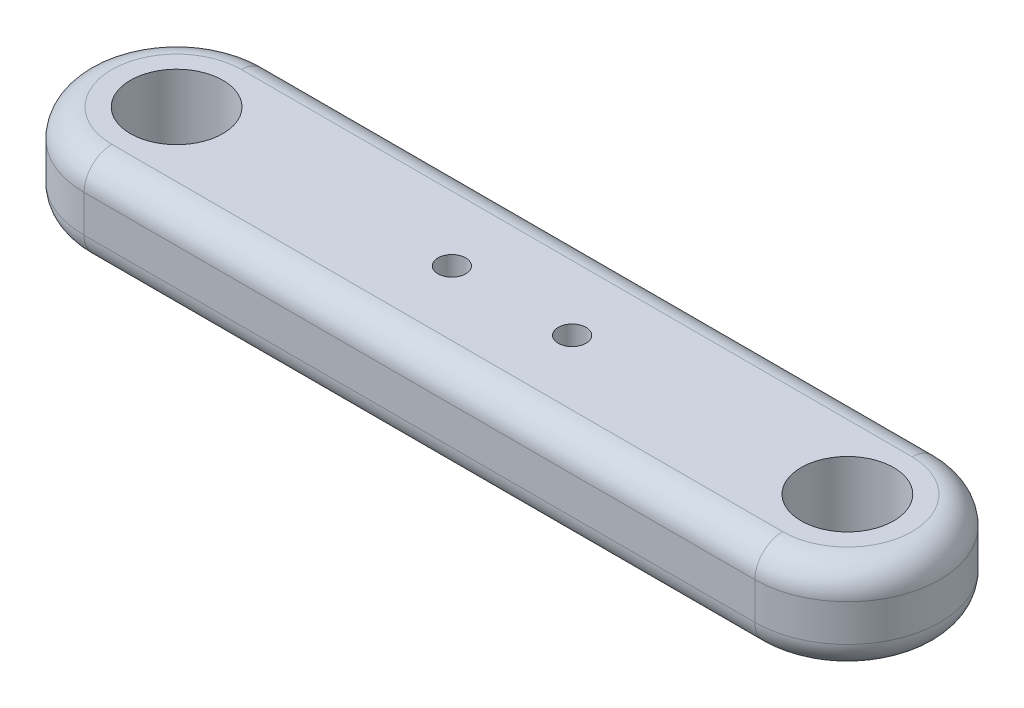
ISO-10303-21;
HEADER;
FILE_DESCRIPTION(('STEP AP214'),'2;1');
FILE_NAME('part.step','',(''),(''),'','','');
FILE_SCHEMA(('AUTOMOTIVE_DESIGN { 1 0 10303 214 1 1 1 1 }'));
ENDSEC;
DATA;
#1=APPLICATION_CONTEXT('core data for automotive mechanical design processes');
#2=APPLICATION_PROTOCOL_DEFINITION('international standard','automotive_design',2000,#1);
#3=PRODUCT_CONTEXT('',#1,'mechanical');
#4=PRODUCT('Part','Part','',(#3));
#5=PRODUCT_RELATED_PRODUCT_CATEGORY('part','',(#4));
#6=PRODUCT_DEFINITION_FORMATION('','',#4);
#7=PRODUCT_DEFINITION_CONTEXT('part definition',#1,'design');
#8=PRODUCT_DEFINITION('design','',#6,#7);
#9=PRODUCT_DEFINITION_SHAPE('','',#8);
#10=(LENGTH_UNIT() NAMED_UNIT(*) SI_UNIT(.MILLI.,.METRE.));
#11=(NAMED_UNIT(*) PLANE_ANGLE_UNIT() SI_UNIT($,.RADIAN.));
#12=(NAMED_UNIT(*) SI_UNIT($,.STERADIAN.) SOLID_ANGLE_UNIT());
#13=UNCERTAINTY_MEASURE_WITH_UNIT(LENGTH_MEASURE(1.E-05),#10,'distance_accuracy_value','');
#14=(GEOMETRIC_REPRESENTATION_CONTEXT(3) GLOBAL_UNCERTAINTY_ASSIGNED_CONTEXT((#13)) GLOBAL_UNIT_ASSIGNED_CONTEXT((#10,
#11,#12)) REPRESENTATION_CONTEXT('',''));
#15=CARTESIAN_POINT('',(0.,0.,0.));
#16=DIRECTION('',(0.,0.,1.));
#17=DIRECTION('',(1.,0.,0.));
#18=AXIS2_PLACEMENT_3D('',#15,#16,#17);
#19=CARTESIAN_POINT('',(0.,10.,10.));
#20=DIRECTION('',(0.,0.,1.));
#21=DIRECTION('',(1.,0.,0.));
#22=AXIS2_PLACEMENT_3D('',#19,#20,#21);
#23=PLANE('',#22);
#24=DIRECTION('',(0.,-1.,0.));
#25=VECTOR('',#24,1.);
#26=CARTESIAN_POINT('',(-36.25,10.,10.));
#27=LINE('',#26,#25);
#28=CARTESIAN_POINT('',(-36.25,7.,10.));
#29=VERTEX_POINT('',#28);
#30=CARTESIAN_POINT('',(-36.25,3.,10.));
#31=VERTEX_POINT('',#30);
#32=EDGE_CURVE('E104',#29,#31,#27,.T.);
#33=ORIENTED_EDGE('',*,*,#32,.T.);
#34=DIRECTION('',(-1.,0.,0.));
#35=VECTOR('',#34,1.);
#36=CARTESIAN_POINT('',(36.25,3.,10.));
#37=LINE('',#36,#35);
#38=CARTESIAN_POINT('',(36.25,3.,10.));
#39=VERTEX_POINT('',#38);
#40=EDGE_CURVE('E110',#31,#39,#37,.F.);
#41=ORIENTED_EDGE('',*,*,#40,.T.);
#42=DIRECTION('',(0.,-1.,0.));
#43=VECTOR('',#42,1.);
#44=CARTESIAN_POINT('',(36.25,10.,10.));
#45=LINE('',#44,#43);
#46=CARTESIAN_POINT('',(36.25,7.,10.));
#47=VERTEX_POINT('',#46);
#48=EDGE_CURVE('E106',#47,#39,#45,.T.);
#49=ORIENTED_EDGE('',*,*,#48,.F.);
#50=DIRECTION('',(-1.,0.,0.));
#51=VECTOR('',#50,1.);
#52=CARTESIAN_POINT('',(0.,7.,10.));
#53=LINE('',#52,#51);
#54=EDGE_CURVE('E102',#47,#29,#53,.T.);
#55=ORIENTED_EDGE('',*,*,#54,.T.);
#56=EDGE_LOOP('',(#33,#41,#49,#55));
#57=FACE_BOUND('',#56,.T.);
#58=ADVANCED_FACE('F33',(#57),#23,.T.);
#59=CARTESIAN_POINT('',(36.25,10.,0.));
#60=DIRECTION('',(0.,-1.,0.));
#61=DIRECTION('',(0.,0.,-1.));
#62=AXIS2_PLACEMENT_3D('',#59,#60,#61);
#63=CYLINDRICAL_SURFACE('',#62,10.);
#64=ORIENTED_EDGE('',*,*,#48,.T.);
#65=CARTESIAN_POINT('',(36.25,3.,0.));
#66=DIRECTION('',(0.,1.,0.));
#67=DIRECTION('',(0.,0.,1.));
#68=AXIS2_PLACEMENT_3D('',#65,#66,#67);
#69=CIRCLE('',#68,10.);
#70=CARTESIAN_POINT('',(36.25,3.,-10.));
#71=VERTEX_POINT('',#70);
#72=EDGE_CURVE('E184',#39,#71,#69,.T.);
#73=ORIENTED_EDGE('',*,*,#72,.T.);
#74=DIRECTION('',(0.,-1.,0.));
#75=VECTOR('',#74,1.);
#76=CARTESIAN_POINT('',(36.25,10.,-10.));
#77=LINE('',#76,#75);
#78=CARTESIAN_POINT('',(36.25,7.,-10.));
#79=VERTEX_POINT('',#78);
#80=EDGE_CURVE('E168',#79,#71,#77,.T.);
#81=ORIENTED_EDGE('',*,*,#80,.F.);
#82=CARTESIAN_POINT('',(36.25,7.,0.));
#83=DIRECTION('',(0.,1.,0.));
#84=DIRECTION('',(0.,0.,1.));
#85=AXIS2_PLACEMENT_3D('',#82,#83,#84);
#86=CIRCLE('',#85,10.);
#87=EDGE_CURVE('E182',#79,#47,#86,.F.);
#88=ORIENTED_EDGE('',*,*,#87,.T.);
#89=EDGE_LOOP('',(#64,#73,#81,#88));
#90=FACE_BOUND('',#89,.T.);
#91=ADVANCED_FACE('F222',(#90),#63,.T.);
#92=CARTESIAN_POINT('',(0.,10.,-10.));
#93=DIRECTION('',(0.,0.,-1.));
#94=DIRECTION('',(-1.,0.,0.));
#95=AXIS2_PLACEMENT_3D('',#92,#93,#94);
#96=PLANE('',#95);
#97=ORIENTED_EDGE('',*,*,#80,.T.);
#98=DIRECTION('',(1.,0.,0.));
#99=VECTOR('',#98,1.);
#100=CARTESIAN_POINT('',(-36.25,3.,-10.));
#101=LINE('',#100,#99);
#102=CARTESIAN_POINT('',(-36.25,3.,-10.));
#103=VERTEX_POINT('',#102);
#104=EDGE_CURVE('E11',#71,#103,#101,.F.);
#105=ORIENTED_EDGE('',*,*,#104,.T.);
#106=DIRECTION('',(0.,-1.,0.));
#107=VECTOR('',#106,1.);
#108=CARTESIAN_POINT('',(-36.25,10.,-10.));
#109=LINE('',#108,#107);
#110=CARTESIAN_POINT('',(-36.25,7.,-10.));
#111=VERTEX_POINT('',#110);
#112=EDGE_CURVE('E122',#111,#103,#109,.T.);
#113=ORIENTED_EDGE('',*,*,#112,.F.);
#114=DIRECTION('',(1.,0.,0.));
#115=VECTOR('',#114,1.);
#116=CARTESIAN_POINT('',(0.,7.,-10.));
#117=LINE('',#116,#115);
#118=EDGE_CURVE('E42',#111,#79,#117,.T.);
#119=ORIENTED_EDGE('',*,*,#118,.T.);
#120=EDGE_LOOP('',(#97,#105,#113,#119));
#121=FACE_BOUND('',#120,.T.);
#122=ADVANCED_FACE('F243',(#121),#96,.T.);
#123=CARTESIAN_POINT('',(36.25,10.,0.));
#124=DIRECTION('',(0.,-1.,0.));
#125=DIRECTION('',(0.,0.,-1.));
#126=AXIS2_PLACEMENT_3D('',#123,#124,#125);
#127=CYLINDRICAL_SURFACE('',#126,5.);
#128=CARTESIAN_POINT('',(36.25,10.,0.));
#129=DIRECTION('',(0.,1.,0.));
#130=DIRECTION('',(0.,0.,1.));
#131=AXIS2_PLACEMENT_3D('',#128,#129,#130);
#132=CIRCLE('',#131,5.);
#133=CARTESIAN_POINT('',(36.25,10.,5.));
#134=VERTEX_POINT('',#133);
#135=EDGE_CURVE('E123',#134,#134,#132,.T.);
#136=ORIENTED_EDGE('',*,*,#135,.T.);
#137=EDGE_LOOP('',(#136));
#138=FACE_BOUND('',#137,.T.);
#139=CARTESIAN_POINT('',(36.25,0.,0.));
#140=DIRECTION('',(0.,1.,0.));
#141=DIRECTION('',(0.,0.,1.));
#142=AXIS2_PLACEMENT_3D('',#139,#140,#141);
#143=CIRCLE('',#142,5.);
#144=CARTESIAN_POINT('',(36.25,0.,5.));
#145=VERTEX_POINT('',#144);
#146=EDGE_CURVE('E159',#145,#145,#143,.T.);
#147=ORIENTED_EDGE('',*,*,#146,.F.);
#148=EDGE_LOOP('',(#147));
#149=FACE_BOUND('',#148,.T.);
#150=ADVANCED_FACE('F239',(#138,#149),#127,.F.);
#151=CARTESIAN_POINT('',(-36.25,10.,0.));
#152=DIRECTION('',(0.,-1.,0.));
#153=DIRECTION('',(0.,0.,-1.));
#154=AXIS2_PLACEMENT_3D('',#151,#152,#153);
#155=CYLINDRICAL_SURFACE('',#154,5.);
#156=CARTESIAN_POINT('',(-36.25,10.,0.));
#157=DIRECTION('',(0.,1.,0.));
#158=DIRECTION('',(0.,0.,1.));
#159=AXIS2_PLACEMENT_3D('',#156,#157,#158);
#160=CIRCLE('',#159,5.);
#161=CARTESIAN_POINT('',(-36.25,10.,5.00000000000001));
#162=VERTEX_POINT('',#161);
#163=EDGE_CURVE('E156',#162,#162,#160,.T.);
#164=ORIENTED_EDGE('',*,*,#163,.T.);
#165=EDGE_LOOP('',(#164));
#166=FACE_BOUND('',#165,.T.);
#167=CARTESIAN_POINT('',(-36.25,0.,0.));
#168=DIRECTION('',(0.,1.,0.));
#169=DIRECTION('',(0.,0.,1.));
#170=AXIS2_PLACEMENT_3D('',#167,#168,#169);
#171=CIRCLE('',#170,5.);
#172=CARTESIAN_POINT('',(-36.25,0.,5.00000000000001));
#173=VERTEX_POINT('',#172);
#174=EDGE_CURVE('E162',#173,#173,#171,.T.);
#175=ORIENTED_EDGE('',*,*,#174,.F.);
#176=EDGE_LOOP('',(#175));
#177=FACE_BOUND('',#176,.T.);
#178=ADVANCED_FACE('F242',(#166,#177),#155,.F.);
#179=CARTESIAN_POINT('',(-36.25,10.,0.));
#180=DIRECTION('',(0.,-1.,0.));
#181=DIRECTION('',(0.,0.,-1.));
#182=AXIS2_PLACEMENT_3D('',#179,#180,#181);
#183=CYLINDRICAL_SURFACE('',#182,10.);
#184=ORIENTED_EDGE('',*,*,#112,.T.);
#185=CARTESIAN_POINT('',(-36.25,3.,0.));
#186=DIRECTION('',(0.,1.,0.));
#187=DIRECTION('',(0.,0.,1.));
#188=AXIS2_PLACEMENT_3D('',#185,#186,#187);
#189=CIRCLE('',#188,10.);
#190=EDGE_CURVE('E121',#103,#31,#189,.T.);
#191=ORIENTED_EDGE('',*,*,#190,.T.);
#192=ORIENTED_EDGE('',*,*,#32,.F.);
#193=CARTESIAN_POINT('',(-36.25,7.,0.));
#194=DIRECTION('',(0.,1.,0.));
#195=DIRECTION('',(0.,0.,1.));
#196=AXIS2_PLACEMENT_3D('',#193,#194,#195);
#197=CIRCLE('',#196,10.);
#198=EDGE_CURVE('E118',#29,#111,#197,.F.);
#199=ORIENTED_EDGE('',*,*,#198,.T.);
#200=EDGE_LOOP('',(#184,#191,#192,#199));
#201=FACE_BOUND('',#200,.T.);
#202=ADVANCED_FACE('F117',(#201),#183,.T.);
#203=CARTESIAN_POINT('',(0.,10.,0.));
#204=DIRECTION('',(0.,1.,0.));
#205=DIRECTION('',(0.,0.,1.));
#206=AXIS2_PLACEMENT_3D('',#203,#204,#205);
#207=PLANE('',#206);
#208=CARTESIAN_POINT('',(-6.5,10.,0.));
#209=DIRECTION('',(0.,1.,0.));
#210=DIRECTION('',(0.,0.,1.));
#211=AXIS2_PLACEMENT_3D('',#208,#209,#210);
#212=CIRCLE('',#211,1.5);
#213=CARTESIAN_POINT('',(-6.5,10.,1.5));
#214=VERTEX_POINT('',#213);
#215=EDGE_CURVE('E145',#214,#214,#212,.T.);
#216=ORIENTED_EDGE('',*,*,#215,.F.);
#217=EDGE_LOOP('',(#216));
#218=FACE_BOUND('',#217,.T.);
#219=CARTESIAN_POINT('',(6.5,10.,0.));
#220=DIRECTION('',(0.,1.,0.));
#221=DIRECTION('',(0.,0.,1.));
#222=AXIS2_PLACEMENT_3D('',#219,#220,#221);
#223=CIRCLE('',#222,1.5);
#224=CARTESIAN_POINT('',(6.5,10.,1.5));
#225=VERTEX_POINT('',#224);
#226=EDGE_CURVE('E149',#225,#225,#223,.T.);
#227=ORIENTED_EDGE('',*,*,#226,.F.);
#228=EDGE_LOOP('',(#227));
#229=FACE_BOUND('',#228,.T.);
#230=DIRECTION('',(1.,0.,0.));
#231=VECTOR('',#230,1.);
#232=CARTESIAN_POINT('',(0.,10.,-7.));
#233=LINE('',#232,#231);
#234=CARTESIAN_POINT('',(36.25,10.,-7.));
#235=VERTEX_POINT('',#234);
#236=CARTESIAN_POINT('',(-36.25,10.,-7.));
#237=VERTEX_POINT('',#236);
#238=EDGE_CURVE('E186',#235,#237,#233,.F.);
#239=ORIENTED_EDGE('',*,*,#238,.T.);
#240=CARTESIAN_POINT('',(-36.25,10.,0.));
#241=DIRECTION('',(0.,1.,0.));
#242=DIRECTION('',(0.,0.,1.));
#243=AXIS2_PLACEMENT_3D('',#240,#241,#242);
#244=CIRCLE('',#243,7.00000000000001);
#245=CARTESIAN_POINT('',(-36.25,10.,7.00000000000001));
#246=VERTEX_POINT('',#245);
#247=EDGE_CURVE('E191',#237,#246,#244,.T.);
#248=ORIENTED_EDGE('',*,*,#247,.T.);
#249=DIRECTION('',(-1.,0.,0.));
#250=VECTOR('',#249,1.);
#251=CARTESIAN_POINT('',(0.,10.,7.00000000000001));
#252=LINE('',#251,#250);
#253=CARTESIAN_POINT('',(36.25,10.,7.));
#254=VERTEX_POINT('',#253);
#255=EDGE_CURVE('E57',#246,#254,#252,.F.);
#256=ORIENTED_EDGE('',*,*,#255,.T.);
#257=CARTESIAN_POINT('',(36.25,10.,0.));
#258=DIRECTION('',(0.,1.,0.));
#259=DIRECTION('',(0.,0.,1.));
#260=AXIS2_PLACEMENT_3D('',#257,#258,#259);
#261=CIRCLE('',#260,7.);
#262=EDGE_CURVE('E188',#254,#235,#261,.T.);
#263=ORIENTED_EDGE('',*,*,#262,.T.);
#264=EDGE_LOOP('',(#239,#248,#256,#263));
#265=FACE_BOUND('',#264,.T.);
#266=ORIENTED_EDGE('',*,*,#163,.F.);
#267=EDGE_LOOP('',(#266));
#268=FACE_BOUND('',#267,.T.);
#269=ORIENTED_EDGE('',*,*,#135,.F.);
#270=EDGE_LOOP('',(#269));
#271=FACE_BOUND('',#270,.T.);
#272=ADVANCED_FACE('F230',(#218,#229,#265,#268,#271),#207,.T.);
#273=CARTESIAN_POINT('',(0.,0.,0.));
#274=DIRECTION('',(0.,1.,0.));
#275=DIRECTION('',(0.,0.,1.));
#276=AXIS2_PLACEMENT_3D('',#273,#274,#275);
#277=PLANE('',#276);
#278=CARTESIAN_POINT('',(-6.5,0.,0.));
#279=DIRECTION('',(0.,1.,0.));
#280=DIRECTION('',(0.,0.,1.));
#281=AXIS2_PLACEMENT_3D('',#278,#279,#280);
#282=CIRCLE('',#281,1.5);
#283=CARTESIAN_POINT('',(-6.5,0.,1.5));
#284=VERTEX_POINT('',#283);
#285=EDGE_CURVE('E37',#284,#284,#282,.T.);
#286=ORIENTED_EDGE('',*,*,#285,.T.);
#287=EDGE_LOOP('',(#286));
#288=FACE_BOUND('',#287,.T.);
#289=CARTESIAN_POINT('',(6.5,0.,0.));
#290=DIRECTION('',(0.,1.,0.));
#291=DIRECTION('',(0.,0.,1.));
#292=AXIS2_PLACEMENT_3D('',#289,#290,#291);
#293=CIRCLE('',#292,1.5);
#294=CARTESIAN_POINT('',(6.5,0.,1.5));
#295=VERTEX_POINT('',#294);
#296=EDGE_CURVE('E135',#295,#295,#293,.T.);
#297=ORIENTED_EDGE('',*,*,#296,.T.);
#298=EDGE_LOOP('',(#297));
#299=FACE_BOUND('',#298,.T.);
#300=DIRECTION('',(-1.,0.,0.));
#301=VECTOR('',#300,1.);
#302=CARTESIAN_POINT('',(-36.25,0.,7.00000000000001));
#303=LINE('',#302,#301);
#304=CARTESIAN_POINT('',(36.25,0.,7.));
#305=VERTEX_POINT('',#304);
#306=CARTESIAN_POINT('',(-36.25,0.,7.00000000000001));
#307=VERTEX_POINT('',#306);
#308=EDGE_CURVE('E177',#305,#307,#303,.T.);
#309=ORIENTED_EDGE('',*,*,#308,.T.);
#310=CARTESIAN_POINT('',(-36.25,0.,0.));
#311=DIRECTION('',(0.,1.,0.));
#312=DIRECTION('',(0.,0.,1.));
#313=AXIS2_PLACEMENT_3D('',#310,#311,#312);
#314=CIRCLE('',#313,7.00000000000001);
#315=CARTESIAN_POINT('',(-36.25,0.,-7.));
#316=VERTEX_POINT('',#315);
#317=EDGE_CURVE('E111',#307,#316,#314,.F.);
#318=ORIENTED_EDGE('',*,*,#317,.T.);
#319=DIRECTION('',(1.,0.,0.));
#320=VECTOR('',#319,1.);
#321=CARTESIAN_POINT('',(36.25,0.,-7.));
#322=LINE('',#321,#320);
#323=CARTESIAN_POINT('',(36.25,0.,-7.));
#324=VERTEX_POINT('',#323);
#325=EDGE_CURVE('E173',#316,#324,#322,.T.);
#326=ORIENTED_EDGE('',*,*,#325,.T.);
#327=CARTESIAN_POINT('',(36.25,0.,0.));
#328=DIRECTION('',(0.,1.,0.));
#329=DIRECTION('',(0.,0.,1.));
#330=AXIS2_PLACEMENT_3D('',#327,#328,#329);
#331=CIRCLE('',#330,7.);
#332=EDGE_CURVE('E175',#324,#305,#331,.F.);
#333=ORIENTED_EDGE('',*,*,#332,.T.);
#334=EDGE_LOOP('',(#309,#318,#326,#333));
#335=FACE_BOUND('',#334,.T.);
#336=ORIENTED_EDGE('',*,*,#174,.T.);
#337=EDGE_LOOP('',(#336));
#338=FACE_BOUND('',#337,.T.);
#339=ORIENTED_EDGE('',*,*,#146,.T.);
#340=EDGE_LOOP('',(#339));
#341=FACE_BOUND('',#340,.T.);
#342=ADVANCED_FACE('F214',(#288,#299,#335,#338,#341),#277,.F.);
#343=CARTESIAN_POINT('',(36.25,3.,0.));
#344=DIRECTION('',(0.,1.,0.));
#345=DIRECTION('',(0.,0.,1.));
#346=AXIS2_PLACEMENT_3D('',#343,#344,#345);
#347=TOROIDAL_SURFACE('',#346,7.,3.);
#348=CARTESIAN_POINT('',(36.25,3.,7.));
#349=DIRECTION('',(-1.,0.,0.));
#350=DIRECTION('',(0.,0.,1.));
#351=AXIS2_PLACEMENT_3D('',#348,#349,#350);
#352=CIRCLE('',#351,3.);
#353=EDGE_CURVE('E196',#305,#39,#352,.T.);
#354=ORIENTED_EDGE('',*,*,#353,.F.);
#355=ORIENTED_EDGE('',*,*,#332,.F.);
#356=CARTESIAN_POINT('',(36.25,3.,-7.));
#357=DIRECTION('',(-1.,0.,0.));
#358=DIRECTION('',(0.,0.,1.));
#359=AXIS2_PLACEMENT_3D('',#356,#357,#358);
#360=CIRCLE('',#359,3.);
#361=EDGE_CURVE('E137',#71,#324,#360,.T.);
#362=ORIENTED_EDGE('',*,*,#361,.F.);
#363=ORIENTED_EDGE('',*,*,#72,.F.);
#364=EDGE_LOOP('',(#354,#355,#362,#363));
#365=FACE_BOUND('',#364,.T.);
#366=ADVANCED_FACE('F212',(#365),#347,.T.);
#367=CARTESIAN_POINT('',(0.,3.,-7.));
#368=DIRECTION('',(-1.,0.,0.));
#369=DIRECTION('',(0.,0.,1.));
#370=AXIS2_PLACEMENT_3D('',#367,#368,#369);
#371=CYLINDRICAL_SURFACE('',#370,3.);
#372=ORIENTED_EDGE('',*,*,#361,.T.);
#373=ORIENTED_EDGE('',*,*,#325,.F.);
#374=CARTESIAN_POINT('',(-36.25,3.,-7.));
#375=DIRECTION('',(-1.,0.,0.));
#376=DIRECTION('',(0.,0.,1.));
#377=AXIS2_PLACEMENT_3D('',#374,#375,#376);
#378=CIRCLE('',#377,3.);
#379=EDGE_CURVE('E195',#103,#316,#378,.T.);
#380=ORIENTED_EDGE('',*,*,#379,.F.);
#381=ORIENTED_EDGE('',*,*,#104,.F.);
#382=EDGE_LOOP('',(#372,#373,#380,#381));
#383=FACE_BOUND('',#382,.T.);
#384=ADVANCED_FACE('F207',(#383),#371,.T.);
#385=CARTESIAN_POINT('',(0.,3.,7.00000000000001));
#386=DIRECTION('',(1.,0.,0.));
#387=DIRECTION('',(0.,0.,-1.));
#388=AXIS2_PLACEMENT_3D('',#385,#386,#387);
#389=CYLINDRICAL_SURFACE('',#388,3.);
#390=ORIENTED_EDGE('',*,*,#353,.T.);
#391=ORIENTED_EDGE('',*,*,#40,.F.);
#392=CARTESIAN_POINT('',(-36.25,3.,7.00000000000001));
#393=DIRECTION('',(-1.,0.,0.));
#394=DIRECTION('',(0.,0.,1.));
#395=AXIS2_PLACEMENT_3D('',#392,#393,#394);
#396=CIRCLE('',#395,3.);
#397=EDGE_CURVE('E143',#307,#31,#396,.T.);
#398=ORIENTED_EDGE('',*,*,#397,.F.);
#399=ORIENTED_EDGE('',*,*,#308,.F.);
#400=EDGE_LOOP('',(#390,#391,#398,#399));
#401=FACE_BOUND('',#400,.T.);
#402=ADVANCED_FACE('F220',(#401),#389,.T.);
#403=CARTESIAN_POINT('',(-36.25,3.,0.));
#404=DIRECTION('',(0.,1.,0.));
#405=DIRECTION('',(0.,0.,1.));
#406=AXIS2_PLACEMENT_3D('',#403,#404,#405);
#407=TOROIDAL_SURFACE('',#406,7.00000000000001,3.);
#408=ORIENTED_EDGE('',*,*,#379,.T.);
#409=ORIENTED_EDGE('',*,*,#317,.F.);
#410=ORIENTED_EDGE('',*,*,#397,.T.);
#411=ORIENTED_EDGE('',*,*,#190,.F.);
#412=EDGE_LOOP('',(#408,#409,#410,#411));
#413=FACE_BOUND('',#412,.T.);
#414=ADVANCED_FACE('F219',(#413),#407,.T.);
#415=CARTESIAN_POINT('',(36.25,7.,0.));
#416=DIRECTION('',(0.,1.,0.));
#417=DIRECTION('',(0.,0.,1.));
#418=AXIS2_PLACEMENT_3D('',#415,#416,#417);
#419=TOROIDAL_SURFACE('',#418,7.,3.);
#420=CARTESIAN_POINT('',(36.25,7.,7.));
#421=DIRECTION('',(-1.,0.,0.));
#422=DIRECTION('',(0.,0.,1.));
#423=AXIS2_PLACEMENT_3D('',#420,#421,#422);
#424=CIRCLE('',#423,3.);
#425=EDGE_CURVE('E132',#47,#254,#424,.T.);
#426=ORIENTED_EDGE('',*,*,#425,.F.);
#427=ORIENTED_EDGE('',*,*,#87,.F.);
#428=CARTESIAN_POINT('',(36.25,7.,-7.));
#429=DIRECTION('',(-1.,0.,0.));
#430=DIRECTION('',(0.,0.,1.));
#431=AXIS2_PLACEMENT_3D('',#428,#429,#430);
#432=CIRCLE('',#431,3.);
#433=EDGE_CURVE('E141',#235,#79,#432,.T.);
#434=ORIENTED_EDGE('',*,*,#433,.F.);
#435=ORIENTED_EDGE('',*,*,#262,.F.);
#436=EDGE_LOOP('',(#426,#427,#434,#435));
#437=FACE_BOUND('',#436,.T.);
#438=ADVANCED_FACE('F35',(#437),#419,.T.);
#439=CARTESIAN_POINT('',(0.,7.,-7.));
#440=DIRECTION('',(1.,0.,0.));
#441=DIRECTION('',(0.,0.,-1.));
#442=AXIS2_PLACEMENT_3D('',#439,#440,#441);
#443=CYLINDRICAL_SURFACE('',#442,3.);
#444=ORIENTED_EDGE('',*,*,#433,.T.);
#445=ORIENTED_EDGE('',*,*,#118,.F.);
#446=CARTESIAN_POINT('',(-36.25,7.,-7.));
#447=DIRECTION('',(-1.,0.,0.));
#448=DIRECTION('',(0.,0.,1.));
#449=AXIS2_PLACEMENT_3D('',#446,#447,#448);
#450=CIRCLE('',#449,3.);
#451=EDGE_CURVE('E127',#237,#111,#450,.T.);
#452=ORIENTED_EDGE('',*,*,#451,.F.);
#453=ORIENTED_EDGE('',*,*,#238,.F.);
#454=EDGE_LOOP('',(#444,#445,#452,#453));
#455=FACE_BOUND('',#454,.T.);
#456=ADVANCED_FACE('F229',(#455),#443,.T.);
#457=CARTESIAN_POINT('',(0.,7.,7.00000000000001));
#458=DIRECTION('',(-1.,0.,0.));
#459=DIRECTION('',(0.,0.,1.));
#460=AXIS2_PLACEMENT_3D('',#457,#458,#459);
#461=CYLINDRICAL_SURFACE('',#460,3.);
#462=ORIENTED_EDGE('',*,*,#425,.T.);
#463=ORIENTED_EDGE('',*,*,#255,.F.);
#464=CARTESIAN_POINT('',(-36.25,7.,7.00000000000001));
#465=DIRECTION('',(-1.,0.,0.));
#466=DIRECTION('',(0.,0.,1.));
#467=AXIS2_PLACEMENT_3D('',#464,#465,#466);
#468=CIRCLE('',#467,3.);
#469=EDGE_CURVE('E50',#29,#246,#468,.T.);
#470=ORIENTED_EDGE('',*,*,#469,.F.);
#471=ORIENTED_EDGE('',*,*,#54,.F.);
#472=EDGE_LOOP('',(#462,#463,#470,#471));
#473=FACE_BOUND('',#472,.T.);
#474=ADVANCED_FACE('F130',(#473),#461,.T.);
#475=CARTESIAN_POINT('',(-36.25,7.,0.));
#476=DIRECTION('',(0.,1.,0.));
#477=DIRECTION('',(0.,0.,1.));
#478=AXIS2_PLACEMENT_3D('',#475,#476,#477);
#479=TOROIDAL_SURFACE('',#478,7.00000000000001,3.);
#480=ORIENTED_EDGE('',*,*,#451,.T.);
#481=ORIENTED_EDGE('',*,*,#198,.F.);
#482=ORIENTED_EDGE('',*,*,#469,.T.);
#483=ORIENTED_EDGE('',*,*,#247,.F.);
#484=EDGE_LOOP('',(#480,#481,#482,#483));
#485=FACE_BOUND('',#484,.T.);
#486=ADVANCED_FACE('F125',(#485),#479,.T.);
#487=CARTESIAN_POINT('',(6.5,-4.,0.));
#488=DIRECTION('',(0.,1.,0.));
#489=DIRECTION('',(0.,0.,1.));
#490=AXIS2_PLACEMENT_3D('',#487,#488,#489);
#491=CYLINDRICAL_SURFACE('',#490,1.5);
#492=ORIENTED_EDGE('',*,*,#226,.T.);
#493=EDGE_LOOP('',(#492));
#494=FACE_BOUND('',#493,.T.);
#495=ORIENTED_EDGE('',*,*,#296,.F.);
#496=EDGE_LOOP('',(#495));
#497=FACE_BOUND('',#496,.T.);
#498=ADVANCED_FACE('F276',(#494,#497),#491,.F.);
#499=CARTESIAN_POINT('',(-6.5,-4.,0.));
#500=DIRECTION('',(0.,1.,0.));
#501=DIRECTION('',(0.,0.,1.));
#502=AXIS2_PLACEMENT_3D('',#499,#500,#501);
#503=CYLINDRICAL_SURFACE('',#502,1.5);
#504=ORIENTED_EDGE('',*,*,#215,.T.);
#505=EDGE_LOOP('',(#504));
#506=FACE_BOUND('',#505,.T.);
#507=ORIENTED_EDGE('',*,*,#285,.F.);
#508=EDGE_LOOP('',(#507));
#509=FACE_BOUND('',#508,.T.);
#510=ADVANCED_FACE('F389',(#506,#509),#503,.F.);
#511=CLOSED_SHELL('',(#58,#91,#122,#150,#178,#202,#272,#342,#366,#384,#402,#414,#438,#456,#474,
#486,#498,#510));
#512=MANIFOLD_SOLID_BREP('B2',#511);
#513=ADVANCED_BREP_SHAPE_REPRESENTATION('',(#18,#512),#14);
#514=SHAPE_DEFINITION_REPRESENTATION(#9,#513);
ENDSEC;
END-ISO-10303-21;
